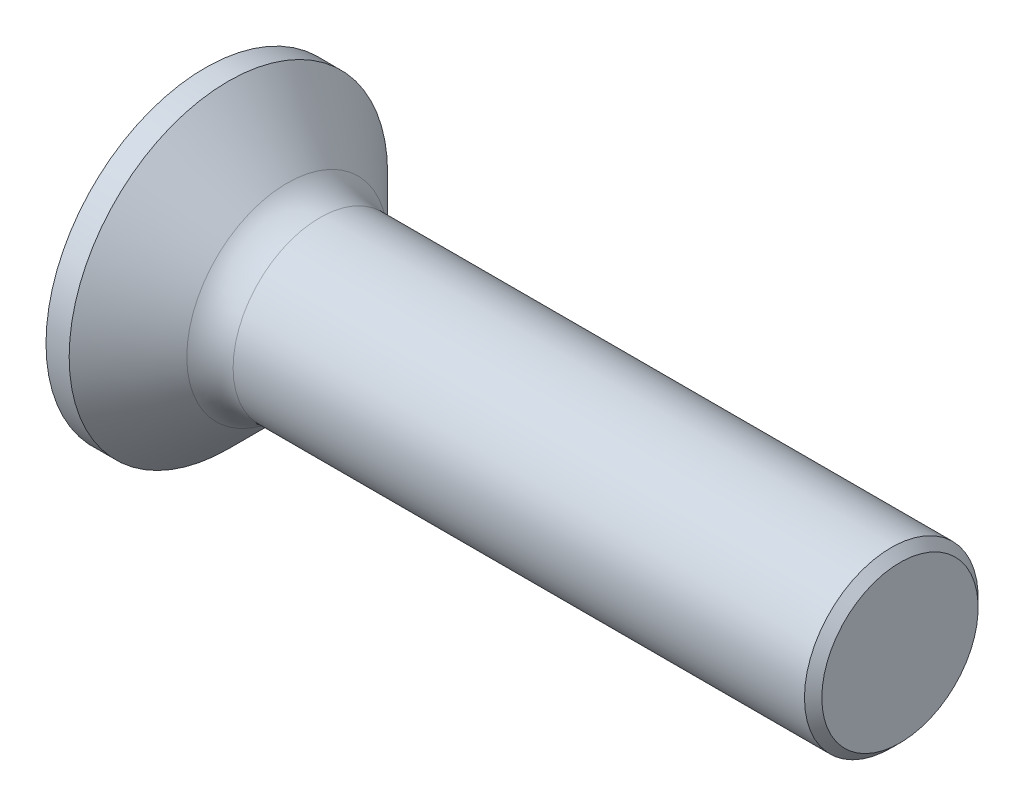
ISO-10303-21;
HEADER;
FILE_DESCRIPTION(('STEP AP214'),'2;1');
FILE_NAME('part.step','',(''),(''),'','','');
FILE_SCHEMA(('AUTOMOTIVE_DESIGN { 1 0 10303 214 1 1 1 1 }'));
ENDSEC;
DATA;
#1=APPLICATION_CONTEXT('core data for automotive mechanical design processes');
#2=APPLICATION_PROTOCOL_DEFINITION('international standard','automotive_design',2000,#1);
#3=PRODUCT_CONTEXT('',#1,'mechanical');
#4=PRODUCT('Part','Part','',(#3));
#5=PRODUCT_RELATED_PRODUCT_CATEGORY('part','',(#4));
#6=PRODUCT_DEFINITION_FORMATION('','',#4);
#7=PRODUCT_DEFINITION_CONTEXT('part definition',#1,'design');
#8=PRODUCT_DEFINITION('design','',#6,#7);
#9=PRODUCT_DEFINITION_SHAPE('','',#8);
#10=(LENGTH_UNIT() NAMED_UNIT(*) SI_UNIT(.MILLI.,.METRE.));
#11=(NAMED_UNIT(*) PLANE_ANGLE_UNIT() SI_UNIT($,.RADIAN.));
#12=(NAMED_UNIT(*) SI_UNIT($,.STERADIAN.) SOLID_ANGLE_UNIT());
#13=UNCERTAINTY_MEASURE_WITH_UNIT(LENGTH_MEASURE(1.E-05),#10,'distance_accuracy_value','');
#14=(GEOMETRIC_REPRESENTATION_CONTEXT(3) GLOBAL_UNCERTAINTY_ASSIGNED_CONTEXT((#13)) GLOBAL_UNIT_ASSIGNED_CONTEXT((#10,
#11,#12)) REPRESENTATION_CONTEXT('',''));
#15=CARTESIAN_POINT('',(0.,0.,0.));
#16=DIRECTION('',(0.,0.,1.));
#17=DIRECTION('',(1.,0.,0.));
#18=AXIS2_PLACEMENT_3D('',#15,#16,#17);
#19=CARTESIAN_POINT('',(0.,0.,-0.425));
#20=DIRECTION('',(0.,0.,1.));
#21=DIRECTION('',(1.,0.,0.));
#22=AXIS2_PLACEMENT_3D('',#19,#20,#21);
#23=PLANE('',#22);
#24=DIRECTION('',(1.,0.,0.));
#25=VECTOR('',#24,1.);
#26=CARTESIAN_POINT('',(0.,-0.419753086419753,-0.425));
#27=LINE('',#26,#25);
#28=CARTESIAN_POINT('',(2.5245,-0.419753086419753,-0.425));
#29=VERTEX_POINT('',#28);
#30=CARTESIAN_POINT('',(1.,-0.419753086419753,-0.425));
#31=VERTEX_POINT('',#30);
#32=EDGE_CURVE('E398',#29,#31,#27,.F.);
#33=ORIENTED_EDGE('',*,*,#32,.T.);
#34=DIRECTION('',(0.,1.,0.));
#35=VECTOR('',#34,1.);
#36=CARTESIAN_POINT('',(1.,0.,-0.425));
#37=LINE('',#36,#35);
#38=CARTESIAN_POINT('',(1.,-0.55003270446328,-0.425));
#39=VERTEX_POINT('',#38);
#40=EDGE_CURVE('E225',#31,#39,#37,.F.);
#41=ORIENTED_EDGE('',*,*,#40,.T.);
#42=DIRECTION('',(1.,0.,0.));
#43=VECTOR('',#42,1.);
#44=CARTESIAN_POINT('',(0.,-0.55003270446328,-0.425));
#45=LINE('',#44,#43);
#46=CARTESIAN_POINT('',(0.,-0.55003270446328,-0.425));
#47=VERTEX_POINT('',#46);
#48=EDGE_CURVE('E199',#39,#47,#45,.F.);
#49=ORIENTED_EDGE('',*,*,#48,.T.);
#50=DIRECTION('',(0.,1.,0.));
#51=VECTOR('',#50,1.);
#52=CARTESIAN_POINT('',(0.,0.,-0.425));
#53=LINE('',#52,#51);
#54=CARTESIAN_POINT('',(0.,-1.7,-0.425));
#55=VERTEX_POINT('',#54);
#56=EDGE_CURVE('E206',#47,#55,#53,.F.);
#57=ORIENTED_EDGE('',*,*,#56,.T.);
#58=DIRECTION('',(1.,0.,0.));
#59=VECTOR('',#58,1.);
#60=CARTESIAN_POINT('',(0.,-1.7,-0.425));
#61=LINE('',#60,#59);
#62=CARTESIAN_POINT('',(0.825,-1.7,-0.425));
#63=VERTEX_POINT('',#62);
#64=EDGE_CURVE('E215',#55,#63,#61,.T.);
#65=ORIENTED_EDGE('',*,*,#64,.T.);
#66=DIRECTION('',(0.799915270195533,0.600112956457372,0.));
#67=VECTOR('',#66,1.);
#68=CARTESIAN_POINT('',(0.825,-1.7,-0.425));
#69=LINE('',#68,#67);
#70=CARTESIAN_POINT('',(2.5245,-0.425,-0.425));
#71=VERTEX_POINT('',#70);
#72=EDGE_CURVE('E392',#63,#71,#69,.T.);
#73=ORIENTED_EDGE('',*,*,#72,.T.);
#74=DIRECTION('',(0.,1.,0.));
#75=VECTOR('',#74,1.);
#76=CARTESIAN_POINT('',(2.5245,0.,-0.425));
#77=LINE('',#76,#75);
#78=EDGE_CURVE('E400',#71,#29,#77,.T.);
#79=ORIENTED_EDGE('',*,*,#78,.T.);
#80=EDGE_LOOP('',(#33,#41,#49,#57,#65,#73,#79));
#81=FACE_BOUND('',#80,.T.);
#82=ADVANCED_FACE('F15',(#81),#23,.T.);
#83=CARTESIAN_POINT('',(0.825,-1.7,0.425));
#84=DIRECTION('',(0.600112956457372,-0.799915270195533,0.));
#85=DIRECTION('',(0.799915270195533,0.600112956457372,0.));
#86=AXIS2_PLACEMENT_3D('',#83,#84,#85);
#87=PLANE('',#86);
#88=DIRECTION('',(0.,0.,1.));
#89=VECTOR('',#88,1.);
#90=CARTESIAN_POINT('',(0.825,-1.7,0.425));
#91=LINE('',#90,#89);
#92=CARTESIAN_POINT('',(0.825,-1.7,0.425));
#93=VERTEX_POINT('',#92);
#94=EDGE_CURVE('E395',#93,#63,#91,.F.);
#95=ORIENTED_EDGE('',*,*,#94,.F.);
#96=DIRECTION('',(0.799915270195533,0.600112956457372,0.));
#97=VECTOR('',#96,1.);
#98=CARTESIAN_POINT('',(0.825,-1.7,0.425));
#99=LINE('',#98,#97);
#100=CARTESIAN_POINT('',(2.5245,-0.425,0.425));
#101=VERTEX_POINT('',#100);
#102=EDGE_CURVE('E383',#93,#101,#99,.T.);
#103=ORIENTED_EDGE('',*,*,#102,.T.);
#104=DIRECTION('',(0.,0.,-1.));
#105=VECTOR('',#104,1.);
#106=CARTESIAN_POINT('',(2.5245,-0.425,0.425));
#107=LINE('',#106,#105);
#108=EDGE_CURVE('E389',#101,#71,#107,.T.);
#109=ORIENTED_EDGE('',*,*,#108,.T.);
#110=ORIENTED_EDGE('',*,*,#72,.F.);
#111=EDGE_LOOP('',(#95,#103,#109,#110));
#112=FACE_BOUND('',#111,.T.);
#113=ADVANCED_FACE('F406',(#112),#87,.F.);
#114=CARTESIAN_POINT('',(2.5245,-0.425,0.425));
#115=DIRECTION('',(1.,0.,0.));
#116=DIRECTION('',(0.,0.,-1.));
#117=AXIS2_PLACEMENT_3D('',#114,#115,#116);
#118=PLANE('',#117);
#119=ORIENTED_EDGE('',*,*,#78,.F.);
#120=ORIENTED_EDGE('',*,*,#108,.F.);
#121=DIRECTION('',(0.,1.,0.));
#122=VECTOR('',#121,1.);
#123=CARTESIAN_POINT('',(2.5245,0.,0.425));
#124=LINE('',#123,#122);
#125=CARTESIAN_POINT('',(2.5245,-0.419753086419753,0.425));
#126=VERTEX_POINT('',#125);
#127=EDGE_CURVE('E381',#101,#126,#124,.T.);
#128=ORIENTED_EDGE('',*,*,#127,.T.);
#129=DIRECTION('',(0.,0.,1.));
#130=VECTOR('',#129,1.);
#131=CARTESIAN_POINT('',(2.5245,-0.419753086419753,0.));
#132=LINE('',#131,#130);
#133=EDGE_CURVE('E357',#29,#126,#132,.T.);
#134=ORIENTED_EDGE('',*,*,#133,.F.);
#135=EDGE_LOOP('',(#119,#120,#128,#134));
#136=FACE_BOUND('',#135,.T.);
#137=ADVANCED_FACE('F411',(#136),#118,.F.);
#138=CARTESIAN_POINT('',(0.,0.,0.425));
#139=DIRECTION('',(0.,0.,1.));
#140=DIRECTION('',(1.,0.,0.));
#141=AXIS2_PLACEMENT_3D('',#138,#139,#140);
#142=PLANE('',#141);
#143=DIRECTION('',(0.,1.,0.));
#144=VECTOR('',#143,1.);
#145=CARTESIAN_POINT('',(1.,0.,0.425));
#146=LINE('',#145,#144);
#147=CARTESIAN_POINT('',(1.,-0.419753086419753,0.425));
#148=VERTEX_POINT('',#147);
#149=CARTESIAN_POINT('',(1.,-0.55003270446328,0.425));
#150=VERTEX_POINT('',#149);
#151=EDGE_CURVE('E379',#148,#150,#146,.F.);
#152=ORIENTED_EDGE('',*,*,#151,.F.);
#153=DIRECTION('',(1.,0.,0.));
#154=VECTOR('',#153,1.);
#155=CARTESIAN_POINT('',(0.,-0.419753086419753,0.425));
#156=LINE('',#155,#154);
#157=EDGE_CURVE('E354',#126,#148,#156,.F.);
#158=ORIENTED_EDGE('',*,*,#157,.F.);
#159=ORIENTED_EDGE('',*,*,#127,.F.);
#160=ORIENTED_EDGE('',*,*,#102,.F.);
#161=DIRECTION('',(1.,0.,0.));
#162=VECTOR('',#161,1.);
#163=CARTESIAN_POINT('',(0.,-1.7,0.425));
#164=LINE('',#163,#162);
#165=CARTESIAN_POINT('',(0.,-1.7,0.425));
#166=VERTEX_POINT('',#165);
#167=EDGE_CURVE('E385',#166,#93,#164,.T.);
#168=ORIENTED_EDGE('',*,*,#167,.F.);
#169=DIRECTION('',(0.,1.,0.));
#170=VECTOR('',#169,1.);
#171=CARTESIAN_POINT('',(0.,0.,0.425));
#172=LINE('',#171,#170);
#173=CARTESIAN_POINT('',(0.,-0.55003270446328,0.425));
#174=VERTEX_POINT('',#173);
#175=EDGE_CURVE('E387',#174,#166,#172,.F.);
#176=ORIENTED_EDGE('',*,*,#175,.F.);
#177=DIRECTION('',(1.,0.,0.));
#178=VECTOR('',#177,1.);
#179=CARTESIAN_POINT('',(0.,-0.55003270446328,0.425));
#180=LINE('',#179,#178);
#181=EDGE_CURVE('E377',#150,#174,#180,.F.);
#182=ORIENTED_EDGE('',*,*,#181,.F.);
#183=EDGE_LOOP('',(#152,#158,#159,#160,#168,#176,#182));
#184=FACE_BOUND('',#183,.T.);
#185=ADVANCED_FACE('F415',(#184),#142,.F.);
#186=CARTESIAN_POINT('',(0.,0.,-0.425));
#187=DIRECTION('',(0.,0.,1.));
#188=DIRECTION('',(1.,0.,0.));
#189=AXIS2_PLACEMENT_3D('',#186,#187,#188);
#190=PLANE('',#189);
#191=DIRECTION('',(1.,0.,0.));
#192=VECTOR('',#191,1.);
#193=CARTESIAN_POINT('',(0.,1.7,-0.425));
#194=LINE('',#193,#192);
#195=CARTESIAN_POINT('',(0.825,1.7,-0.425));
#196=VERTEX_POINT('',#195);
#197=CARTESIAN_POINT('',(0.,1.7,-0.425));
#198=VERTEX_POINT('',#197);
#199=EDGE_CURVE('E363',#196,#198,#194,.F.);
#200=ORIENTED_EDGE('',*,*,#199,.T.);
#201=DIRECTION('',(0.,1.,0.));
#202=VECTOR('',#201,1.);
#203=CARTESIAN_POINT('',(0.,0.,-0.425));
#204=LINE('',#203,#202);
#205=CARTESIAN_POINT('',(0.,0.55003270446328,-0.425));
#206=VERTEX_POINT('',#205);
#207=EDGE_CURVE('E360',#198,#206,#204,.F.);
#208=ORIENTED_EDGE('',*,*,#207,.T.);
#209=DIRECTION('',(1.,0.,0.));
#210=VECTOR('',#209,1.);
#211=CARTESIAN_POINT('',(0.,0.55003270446328,-0.425));
#212=LINE('',#211,#210);
#213=CARTESIAN_POINT('',(1.,0.55003270446328,-0.425));
#214=VERTEX_POINT('',#213);
#215=EDGE_CURVE('E374',#206,#214,#212,.T.);
#216=ORIENTED_EDGE('',*,*,#215,.T.);
#217=DIRECTION('',(0.,1.,0.));
#218=VECTOR('',#217,1.);
#219=CARTESIAN_POINT('',(1.,0.,-0.425));
#220=LINE('',#219,#218);
#221=CARTESIAN_POINT('',(1.,0.419753086419753,-0.425));
#222=VERTEX_POINT('',#221);
#223=EDGE_CURVE('E371',#214,#222,#220,.F.);
#224=ORIENTED_EDGE('',*,*,#223,.T.);
#225=DIRECTION('',(1.,0.,0.));
#226=VECTOR('',#225,1.);
#227=CARTESIAN_POINT('',(0.,0.419753086419753,-0.425));
#228=LINE('',#227,#226);
#229=CARTESIAN_POINT('',(2.5245,0.419753086419753,-0.425));
#230=VERTEX_POINT('',#229);
#231=EDGE_CURVE('E368',#222,#230,#228,.T.);
#232=ORIENTED_EDGE('',*,*,#231,.T.);
#233=DIRECTION('',(0.,1.,0.));
#234=VECTOR('',#233,1.);
#235=CARTESIAN_POINT('',(2.5245,0.,-0.425));
#236=LINE('',#235,#234);
#237=CARTESIAN_POINT('',(2.5245,0.425,-0.425));
#238=VERTEX_POINT('',#237);
#239=EDGE_CURVE('E366',#230,#238,#236,.T.);
#240=ORIENTED_EDGE('',*,*,#239,.T.);
#241=DIRECTION('',(-0.799915270195533,0.600112956457372,0.));
#242=VECTOR('',#241,1.);
#243=CARTESIAN_POINT('',(2.5245,0.425,-0.425));
#244=LINE('',#243,#242);
#245=EDGE_CURVE('E335',#238,#196,#244,.T.);
#246=ORIENTED_EDGE('',*,*,#245,.T.);
#247=EDGE_LOOP('',(#200,#208,#216,#224,#232,#240,#246));
#248=FACE_BOUND('',#247,.T.);
#249=ADVANCED_FACE('F463',(#248),#190,.T.);
#250=CARTESIAN_POINT('',(0.,-0.419753086419753,0.));
#251=DIRECTION('',(0.,1.,0.));
#252=DIRECTION('',(0.,0.,1.));
#253=AXIS2_PLACEMENT_3D('',#250,#251,#252);
#254=PLANE('',#253);
#255=DIRECTION('',(0.,0.,1.));
#256=VECTOR('',#255,1.);
#257=CARTESIAN_POINT('',(0.,-0.419753086419753,0.));
#258=LINE('',#257,#256);
#259=CARTESIAN_POINT('',(0.,-0.419753086419753,-1.7));
#260=VERTEX_POINT('',#259);
#261=CARTESIAN_POINT('',(0.,-0.419753086419753,-0.545630021213276));
#262=VERTEX_POINT('',#261);
#263=EDGE_CURVE('E340',#260,#262,#258,.T.);
#264=ORIENTED_EDGE('',*,*,#263,.T.);
#265=DIRECTION('',(1.,0.,0.));
#266=VECTOR('',#265,1.);
#267=CARTESIAN_POINT('',(0.,-0.419753086419753,-0.545630021213276));
#268=LINE('',#267,#266);
#269=CARTESIAN_POINT('',(1.,-0.419753086419753,-0.545630021213276));
#270=VERTEX_POINT('',#269);
#271=EDGE_CURVE('E338',#262,#270,#268,.T.);
#272=ORIENTED_EDGE('',*,*,#271,.T.);
#273=DIRECTION('',(0.,0.,1.));
#274=VECTOR('',#273,1.);
#275=CARTESIAN_POINT('',(1.,-0.419753086419753,0.));
#276=LINE('',#275,#274);
#277=EDGE_CURVE('E329',#31,#270,#276,.F.);
#278=ORIENTED_EDGE('',*,*,#277,.F.);
#279=ORIENTED_EDGE('',*,*,#32,.F.);
#280=ORIENTED_EDGE('',*,*,#133,.T.);
#281=ORIENTED_EDGE('',*,*,#157,.T.);
#282=DIRECTION('',(0.,0.,1.));
#283=VECTOR('',#282,1.);
#284=CARTESIAN_POINT('',(1.,-0.419753086419753,0.));
#285=LINE('',#284,#283);
#286=CARTESIAN_POINT('',(1.,-0.419753086419753,0.545630021213276));
#287=VERTEX_POINT('',#286);
#288=EDGE_CURVE('E332',#287,#148,#285,.F.);
#289=ORIENTED_EDGE('',*,*,#288,.F.);
#290=DIRECTION('',(1.,0.,0.));
#291=VECTOR('',#290,1.);
#292=CARTESIAN_POINT('',(0.,-0.419753086419753,0.545630021213276));
#293=LINE('',#292,#291);
#294=CARTESIAN_POINT('',(0.,-0.419753086419753,0.545630021213276));
#295=VERTEX_POINT('',#294);
#296=EDGE_CURVE('E351',#287,#295,#293,.F.);
#297=ORIENTED_EDGE('',*,*,#296,.T.);
#298=DIRECTION('',(0.,0.,1.));
#299=VECTOR('',#298,1.);
#300=CARTESIAN_POINT('',(0.,-0.419753086419753,0.));
#301=LINE('',#300,#299);
#302=CARTESIAN_POINT('',(0.,-0.419753086419753,1.7));
#303=VERTEX_POINT('',#302);
#304=EDGE_CURVE('E348',#295,#303,#301,.T.);
#305=ORIENTED_EDGE('',*,*,#304,.T.);
#306=DIRECTION('',(1.,0.,0.));
#307=VECTOR('',#306,1.);
#308=CARTESIAN_POINT('',(0.,-0.419753086419753,1.7));
#309=LINE('',#308,#307);
#310=CARTESIAN_POINT('',(0.825,-0.419753086419753,1.7));
#311=VERTEX_POINT('',#310);
#312=EDGE_CURVE('E346',#303,#311,#309,.T.);
#313=ORIENTED_EDGE('',*,*,#312,.T.);
#314=DIRECTION('',(0.802769432970874,0.,-0.596289558425788));
#315=VECTOR('',#314,1.);
#316=CARTESIAN_POINT('',(0.825,-0.419753086419753,1.7));
#317=LINE('',#316,#315);
#318=CARTESIAN_POINT('',(2.5415,-0.419753086419753,0.425));
#319=VERTEX_POINT('',#318);
#320=EDGE_CURVE('E325',#311,#319,#317,.T.);
#321=ORIENTED_EDGE('',*,*,#320,.T.);
#322=DIRECTION('',(0.,0.,-1.));
#323=VECTOR('',#322,1.);
#324=CARTESIAN_POINT('',(2.5415,-0.419753086419753,0.425));
#325=LINE('',#324,#323);
#326=CARTESIAN_POINT('',(2.5415,-0.419753086419753,-0.425));
#327=VERTEX_POINT('',#326);
#328=EDGE_CURVE('E320',#319,#327,#325,.T.);
#329=ORIENTED_EDGE('',*,*,#328,.T.);
#330=DIRECTION('',(-0.802769432970874,0.,-0.596289558425788));
#331=VECTOR('',#330,1.);
#332=CARTESIAN_POINT('',(2.5415,-0.419753086419753,-0.425));
#333=LINE('',#332,#331);
#334=CARTESIAN_POINT('',(0.825,-0.419753086419753,-1.7));
#335=VERTEX_POINT('',#334);
#336=EDGE_CURVE('E314',#327,#335,#333,.T.);
#337=ORIENTED_EDGE('',*,*,#336,.T.);
#338=DIRECTION('',(1.,0.,0.));
#339=VECTOR('',#338,1.);
#340=CARTESIAN_POINT('',(0.,-0.419753086419753,-1.7));
#341=LINE('',#340,#339);
#342=EDGE_CURVE('E343',#335,#260,#341,.F.);
#343=ORIENTED_EDGE('',*,*,#342,.T.);
#344=EDGE_LOOP('',(#264,#272,#278,#279,#280,#281,#289,#297,#305,#313,#321,#329,#337,#343));
#345=FACE_BOUND('',#344,.T.);
#346=ADVANCED_FACE('F420',(#345),#254,.T.);
#347=CARTESIAN_POINT('',(2.5245,0.425,0.425));
#348=DIRECTION('',(0.600112956457372,0.799915270195533,0.));
#349=DIRECTION('',(-0.799915270195533,0.600112956457372,0.));
#350=AXIS2_PLACEMENT_3D('',#347,#348,#349);
#351=PLANE('',#350);
#352=DIRECTION('',(0.,0.,-1.));
#353=VECTOR('',#352,1.);
#354=CARTESIAN_POINT('',(2.5245,0.425,0.425));
#355=LINE('',#354,#353);
#356=CARTESIAN_POINT('',(2.5245,0.425,0.425));
#357=VERTEX_POINT('',#356);
#358=EDGE_CURVE('E327',#238,#357,#355,.F.);
#359=ORIENTED_EDGE('',*,*,#358,.T.);
#360=DIRECTION('',(-0.799915270195533,0.600112956457372,0.));
#361=VECTOR('',#360,1.);
#362=CARTESIAN_POINT('',(2.5245,0.425,0.425));
#363=LINE('',#362,#361);
#364=CARTESIAN_POINT('',(0.825,1.7,0.425));
#365=VERTEX_POINT('',#364);
#366=EDGE_CURVE('E302',#357,#365,#363,.T.);
#367=ORIENTED_EDGE('',*,*,#366,.T.);
#368=DIRECTION('',(0.,0.,1.));
#369=VECTOR('',#368,1.);
#370=CARTESIAN_POINT('',(0.825,1.7,0.425));
#371=LINE('',#370,#369);
#372=EDGE_CURVE('E309',#365,#196,#371,.F.);
#373=ORIENTED_EDGE('',*,*,#372,.T.);
#374=ORIENTED_EDGE('',*,*,#245,.F.);
#375=EDGE_LOOP('',(#359,#367,#373,#374));
#376=FACE_BOUND('',#375,.T.);
#377=ADVANCED_FACE('F590',(#376),#351,.F.);
#378=CARTESIAN_POINT('',(1.,0.,0.));
#379=DIRECTION('',(-1.,0.,0.));
#380=DIRECTION('',(0.,0.,1.));
#381=AXIS2_PLACEMENT_3D('',#378,#379,#380);
#382=PLANE('',#381);
#383=DIRECTION('',(0.,-0.766044443118978,0.642787609686539));
#384=VECTOR('',#383,1.);
#385=CARTESIAN_POINT('',(1.,-1.20208152801713,1.20208152801713));
#386=LINE('',#385,#384);
#387=CARTESIAN_POINT('',(1.,-1.20208152801713,1.20208152801713));
#388=VERTEX_POINT('',#387);
#389=EDGE_CURVE('E287',#388,#287,#386,.F.);
#390=ORIENTED_EDGE('',*,*,#389,.T.);
#391=ORIENTED_EDGE('',*,*,#288,.T.);
#392=ORIENTED_EDGE('',*,*,#151,.T.);
#393=DIRECTION('',(0.,0.642787609686539,-0.766044443118978));
#394=VECTOR('',#393,1.);
#395=CARTESIAN_POINT('',(1.,-0.193415361212936,0.));
#396=LINE('',#395,#394);
#397=EDGE_CURVE('E285',#150,#388,#396,.F.);
#398=ORIENTED_EDGE('',*,*,#397,.T.);
#399=EDGE_LOOP('',(#390,#391,#392,#398));
#400=FACE_BOUND('',#399,.T.);
#401=ADVANCED_FACE('F587',(#400),#382,.T.);
#402=CARTESIAN_POINT('',(1.,0.,0.));
#403=DIRECTION('',(-1.,0.,0.));
#404=DIRECTION('',(0.,0.,1.));
#405=AXIS2_PLACEMENT_3D('',#402,#403,#404);
#406=PLANE('',#405);
#407=DIRECTION('',(0.,0.766044443118978,0.642787609686539));
#408=VECTOR('',#407,1.);
#409=CARTESIAN_POINT('',(1.,0.,-0.193415361212936));
#410=LINE('',#409,#408);
#411=CARTESIAN_POINT('',(1.,-1.20208152801713,-1.20208152801713));
#412=VERTEX_POINT('',#411);
#413=EDGE_CURVE('E279',#270,#412,#410,.F.);
#414=ORIENTED_EDGE('',*,*,#413,.T.);
#415=DIRECTION('',(0.,-0.642787609686539,-0.766044443118978));
#416=VECTOR('',#415,1.);
#417=CARTESIAN_POINT('',(1.,-1.20208152801713,-1.20208152801713));
#418=LINE('',#417,#416);
#419=EDGE_CURVE('E281',#412,#39,#418,.F.);
#420=ORIENTED_EDGE('',*,*,#419,.T.);
#421=ORIENTED_EDGE('',*,*,#40,.F.);
#422=ORIENTED_EDGE('',*,*,#277,.T.);
#423=EDGE_LOOP('',(#414,#420,#421,#422));
#424=FACE_BOUND('',#423,.T.);
#425=ADVANCED_FACE('F424',(#424),#406,.T.);
#426=CARTESIAN_POINT('',(2.5245,-0.425,0.425));
#427=DIRECTION('',(1.,0.,0.));
#428=DIRECTION('',(0.,0.,-1.));
#429=AXIS2_PLACEMENT_3D('',#426,#427,#428);
#430=PLANE('',#429);
#431=DIRECTION('',(0.,1.,0.));
#432=VECTOR('',#431,1.);
#433=CARTESIAN_POINT('',(2.5245,0.,0.425));
#434=LINE('',#433,#432);
#435=CARTESIAN_POINT('',(2.5245,0.419753086419753,0.425));
#436=VERTEX_POINT('',#435);
#437=EDGE_CURVE('E304',#436,#357,#434,.T.);
#438=ORIENTED_EDGE('',*,*,#437,.T.);
#439=ORIENTED_EDGE('',*,*,#358,.F.);
#440=ORIENTED_EDGE('',*,*,#239,.F.);
#441=DIRECTION('',(0.,0.,1.));
#442=VECTOR('',#441,1.);
#443=CARTESIAN_POINT('',(2.5245,0.419753086419753,0.));
#444=LINE('',#443,#442);
#445=EDGE_CURVE('E273',#230,#436,#444,.T.);
#446=ORIENTED_EDGE('',*,*,#445,.T.);
#447=EDGE_LOOP('',(#438,#439,#440,#446));
#448=FACE_BOUND('',#447,.T.);
#449=ADVANCED_FACE('F580',(#448),#430,.F.);
#450=CARTESIAN_POINT('',(1.,0.,0.));
#451=DIRECTION('',(-1.,0.,0.));
#452=DIRECTION('',(0.,0.,1.));
#453=AXIS2_PLACEMENT_3D('',#450,#451,#452);
#454=PLANE('',#453);
#455=DIRECTION('',(0.,-0.766044443118978,-0.642787609686539));
#456=VECTOR('',#455,1.);
#457=CARTESIAN_POINT('',(1.,0.,0.193415361212936));
#458=LINE('',#457,#456);
#459=CARTESIAN_POINT('',(1.,0.419753086419753,0.545630021213276));
#460=VERTEX_POINT('',#459);
#461=CARTESIAN_POINT('',(1.,1.20208152801713,1.20208152801713));
#462=VERTEX_POINT('',#461);
#463=EDGE_CURVE('E294',#460,#462,#458,.F.);
#464=ORIENTED_EDGE('',*,*,#463,.T.);
#465=DIRECTION('',(0.,0.642787609686539,0.766044443118978));
#466=VECTOR('',#465,1.);
#467=CARTESIAN_POINT('',(1.,1.20208152801713,1.20208152801713));
#468=LINE('',#467,#466);
#469=CARTESIAN_POINT('',(1.,0.55003270446328,0.425));
#470=VERTEX_POINT('',#469);
#471=EDGE_CURVE('E298',#462,#470,#468,.F.);
#472=ORIENTED_EDGE('',*,*,#471,.T.);
#473=DIRECTION('',(0.,1.,0.));
#474=VECTOR('',#473,1.);
#475=CARTESIAN_POINT('',(1.,0.,0.425));
#476=LINE('',#475,#474);
#477=CARTESIAN_POINT('',(1.,0.419753086419753,0.425));
#478=VERTEX_POINT('',#477);
#479=EDGE_CURVE('E307',#470,#478,#476,.F.);
#480=ORIENTED_EDGE('',*,*,#479,.T.);
#481=DIRECTION('',(0.,0.,1.));
#482=VECTOR('',#481,1.);
#483=CARTESIAN_POINT('',(1.,0.419753086419753,0.));
#484=LINE('',#483,#482);
#485=EDGE_CURVE('E268',#478,#460,#484,.T.);
#486=ORIENTED_EDGE('',*,*,#485,.T.);
#487=EDGE_LOOP('',(#464,#472,#480,#486));
#488=FACE_BOUND('',#487,.T.);
#489=ADVANCED_FACE('F577',(#488),#454,.T.);
#490=CARTESIAN_POINT('',(0.825,0.419753086419753,1.7));
#491=DIRECTION('',(0.596289558425788,0.,0.802769432970874));
#492=DIRECTION('',(0.802769432970874,0.,-0.596289558425788));
#493=AXIS2_PLACEMENT_3D('',#490,#491,#492);
#494=PLANE('',#493);
#495=DIRECTION('',(0.,1.,0.));
#496=VECTOR('',#495,1.);
#497=CARTESIAN_POINT('',(0.825,0.419753086419753,1.7));
#498=LINE('',#497,#496);
#499=CARTESIAN_POINT('',(0.825,0.419753086419753,1.7));
#500=VERTEX_POINT('',#499);
#501=EDGE_CURVE('E290',#311,#500,#498,.T.);
#502=ORIENTED_EDGE('',*,*,#501,.T.);
#503=DIRECTION('',(0.802769432970874,0.,-0.596289558425788));
#504=VECTOR('',#503,1.);
#505=CARTESIAN_POINT('',(0.825,0.419753086419753,1.7));
#506=LINE('',#505,#504);
#507=CARTESIAN_POINT('',(2.5415,0.419753086419753,0.425));
#508=VERTEX_POINT('',#507);
#509=EDGE_CURVE('E261',#500,#508,#506,.T.);
#510=ORIENTED_EDGE('',*,*,#509,.T.);
#511=DIRECTION('',(0.,1.,0.));
#512=VECTOR('',#511,1.);
#513=CARTESIAN_POINT('',(2.5415,0.419753086419753,0.425));
#514=LINE('',#513,#512);
#515=EDGE_CURVE('E322',#508,#319,#514,.F.);
#516=ORIENTED_EDGE('',*,*,#515,.T.);
#517=ORIENTED_EDGE('',*,*,#320,.F.);
#518=EDGE_LOOP('',(#502,#510,#516,#517));
#519=FACE_BOUND('',#518,.T.);
#520=ADVANCED_FACE('F546',(#519),#494,.F.);
#521=CARTESIAN_POINT('',(2.5415,0.419753086419753,0.425));
#522=DIRECTION('',(1.,0.,0.));
#523=DIRECTION('',(0.,0.,-1.));
#524=AXIS2_PLACEMENT_3D('',#521,#522,#523);
#525=PLANE('',#524);
#526=ORIENTED_EDGE('',*,*,#515,.F.);
#527=DIRECTION('',(0.,0.,1.));
#528=VECTOR('',#527,1.);
#529=CARTESIAN_POINT('',(2.5415,0.419753086419753,0.));
#530=LINE('',#529,#528);
#531=CARTESIAN_POINT('',(2.5415,0.419753086419753,-0.425));
#532=VERTEX_POINT('',#531);
#533=EDGE_CURVE('E259',#508,#532,#530,.F.);
#534=ORIENTED_EDGE('',*,*,#533,.T.);
#535=DIRECTION('',(0.,1.,0.));
#536=VECTOR('',#535,1.);
#537=CARTESIAN_POINT('',(2.5415,0.419753086419753,-0.425));
#538=LINE('',#537,#536);
#539=EDGE_CURVE('E317',#532,#327,#538,.F.);
#540=ORIENTED_EDGE('',*,*,#539,.T.);
#541=ORIENTED_EDGE('',*,*,#328,.F.);
#542=EDGE_LOOP('',(#526,#534,#540,#541));
#543=FACE_BOUND('',#542,.T.);
#544=ADVANCED_FACE('F544',(#543),#525,.F.);
#545=CARTESIAN_POINT('',(2.5415,0.419753086419753,-0.425));
#546=DIRECTION('',(0.596289558425788,0.,-0.802769432970874));
#547=DIRECTION('',(-0.802769432970874,0.,-0.596289558425788));
#548=AXIS2_PLACEMENT_3D('',#545,#546,#547);
#549=PLANE('',#548);
#550=ORIENTED_EDGE('',*,*,#539,.F.);
#551=DIRECTION('',(-0.802769432970874,0.,-0.596289558425788));
#552=VECTOR('',#551,1.);
#553=CARTESIAN_POINT('',(2.5415,0.419753086419753,-0.425));
#554=LINE('',#553,#552);
#555=CARTESIAN_POINT('',(0.825,0.419753086419753,-1.7));
#556=VERTEX_POINT('',#555);
#557=EDGE_CURVE('E257',#532,#556,#554,.T.);
#558=ORIENTED_EDGE('',*,*,#557,.T.);
#559=DIRECTION('',(0.,1.,0.));
#560=VECTOR('',#559,1.);
#561=CARTESIAN_POINT('',(0.825,0.419753086419753,-1.7));
#562=LINE('',#561,#560);
#563=EDGE_CURVE('E275',#556,#335,#562,.F.);
#564=ORIENTED_EDGE('',*,*,#563,.T.);
#565=ORIENTED_EDGE('',*,*,#336,.F.);
#566=EDGE_LOOP('',(#550,#558,#564,#565));
#567=FACE_BOUND('',#566,.T.);
#568=ADVANCED_FACE('F540',(#567),#549,.F.);
#569=CARTESIAN_POINT('',(1.,0.,0.));
#570=DIRECTION('',(-1.,0.,0.));
#571=DIRECTION('',(0.,0.,1.));
#572=AXIS2_PLACEMENT_3D('',#569,#570,#571);
#573=PLANE('',#572);
#574=DIRECTION('',(0.,0.766044443118978,-0.642787609686539));
#575=VECTOR('',#574,1.);
#576=CARTESIAN_POINT('',(1.,1.20208152801713,-1.20208152801713));
#577=LINE('',#576,#575);
#578=CARTESIAN_POINT('',(1.,1.20208152801713,-1.20208152801713));
#579=VERTEX_POINT('',#578);
#580=CARTESIAN_POINT('',(1.,0.419753086419753,-0.545630021213276));
#581=VERTEX_POINT('',#580);
#582=EDGE_CURVE('E247',#579,#581,#577,.F.);
#583=ORIENTED_EDGE('',*,*,#582,.T.);
#584=DIRECTION('',(0.,0.,1.));
#585=VECTOR('',#584,1.);
#586=CARTESIAN_POINT('',(1.,0.419753086419753,0.));
#587=LINE('',#586,#585);
#588=EDGE_CURVE('E252',#581,#222,#587,.T.);
#589=ORIENTED_EDGE('',*,*,#588,.T.);
#590=ORIENTED_EDGE('',*,*,#223,.F.);
#591=DIRECTION('',(0.,-0.642787609686539,0.766044443118978));
#592=VECTOR('',#591,1.);
#593=CARTESIAN_POINT('',(1.,0.193415361212936,0.));
#594=LINE('',#593,#592);
#595=EDGE_CURVE('E312',#214,#579,#594,.F.);
#596=ORIENTED_EDGE('',*,*,#595,.T.);
#597=EDGE_LOOP('',(#583,#589,#590,#596));
#598=FACE_BOUND('',#597,.T.);
#599=ADVANCED_FACE('F567',(#598),#573,.T.);
#600=CARTESIAN_POINT('',(0.,0.193415361212936,0.));
#601=DIRECTION('',(0.,0.766044443118978,0.642787609686539));
#602=DIRECTION('',(0.,-0.642787609686539,0.766044443118978));
#603=AXIS2_PLACEMENT_3D('',#600,#601,#602);
#604=PLANE('',#603);
#605=DIRECTION('',(0.,-0.642787609686539,0.766044443118978));
#606=VECTOR('',#605,1.);
#607=CARTESIAN_POINT('',(0.,1.20208152801713,-1.20208152801713));
#608=LINE('',#607,#606);
#609=CARTESIAN_POINT('',(0.,1.20208152801713,-1.20208152801713));
#610=VERTEX_POINT('',#609);
#611=EDGE_CURVE('E244',#610,#206,#608,.T.);
#612=ORIENTED_EDGE('',*,*,#611,.F.);
#613=DIRECTION('',(1.,0.,0.));
#614=VECTOR('',#613,1.);
#615=CARTESIAN_POINT('',(0.,1.20208152801713,-1.20208152801713));
#616=LINE('',#615,#614);
#617=EDGE_CURVE('E249',#610,#579,#616,.T.);
#618=ORIENTED_EDGE('',*,*,#617,.T.);
#619=ORIENTED_EDGE('',*,*,#595,.F.);
#620=ORIENTED_EDGE('',*,*,#215,.F.);
#621=EDGE_LOOP('',(#612,#618,#619,#620));
#622=FACE_BOUND('',#621,.T.);
#623=ADVANCED_FACE('F564',(#622),#604,.F.);
#624=CARTESIAN_POINT('',(0.825,1.7,0.425));
#625=DIRECTION('',(0.,1.,0.));
#626=DIRECTION('',(0.,0.,1.));
#627=AXIS2_PLACEMENT_3D('',#624,#625,#626);
#628=PLANE('',#627);
#629=ORIENTED_EDGE('',*,*,#199,.F.);
#630=ORIENTED_EDGE('',*,*,#372,.F.);
#631=DIRECTION('',(1.,0.,0.));
#632=VECTOR('',#631,1.);
#633=CARTESIAN_POINT('',(0.,1.7,0.425));
#634=LINE('',#633,#632);
#635=CARTESIAN_POINT('',(0.,1.7,0.425));
#636=VERTEX_POINT('',#635);
#637=EDGE_CURVE('E300',#365,#636,#634,.F.);
#638=ORIENTED_EDGE('',*,*,#637,.T.);
#639=DIRECTION('',(0.,0.,1.));
#640=VECTOR('',#639,1.);
#641=CARTESIAN_POINT('',(0.,1.7,-1.375));
#642=LINE('',#641,#640);
#643=EDGE_CURVE('E455',#198,#636,#642,.T.);
#644=ORIENTED_EDGE('',*,*,#643,.F.);
#645=EDGE_LOOP('',(#629,#630,#638,#644));
#646=FACE_BOUND('',#645,.T.);
#647=ADVANCED_FACE('F467',(#646),#628,.F.);
#648=CARTESIAN_POINT('',(0.,0.,0.425));
#649=DIRECTION('',(0.,0.,1.));
#650=DIRECTION('',(1.,0.,0.));
#651=AXIS2_PLACEMENT_3D('',#648,#649,#650);
#652=PLANE('',#651);
#653=DIRECTION('',(0.,1.,0.));
#654=VECTOR('',#653,1.);
#655=CARTESIAN_POINT('',(0.,0.,0.425));
#656=LINE('',#655,#654);
#657=CARTESIAN_POINT('',(0.,0.55003270446328,0.425));
#658=VERTEX_POINT('',#657);
#659=EDGE_CURVE('E453',#636,#658,#656,.F.);
#660=ORIENTED_EDGE('',*,*,#659,.F.);
#661=ORIENTED_EDGE('',*,*,#637,.F.);
#662=ORIENTED_EDGE('',*,*,#366,.F.);
#663=ORIENTED_EDGE('',*,*,#437,.F.);
#664=DIRECTION('',(1.,0.,0.));
#665=VECTOR('',#664,1.);
#666=CARTESIAN_POINT('',(0.,0.419753086419753,0.425));
#667=LINE('',#666,#665);
#668=EDGE_CURVE('E270',#436,#478,#667,.F.);
#669=ORIENTED_EDGE('',*,*,#668,.T.);
#670=ORIENTED_EDGE('',*,*,#479,.F.);
#671=DIRECTION('',(1.,0.,0.));
#672=VECTOR('',#671,1.);
#673=CARTESIAN_POINT('',(0.,0.55003270446328,0.425));
#674=LINE('',#673,#672);
#675=EDGE_CURVE('E296',#470,#658,#674,.F.);
#676=ORIENTED_EDGE('',*,*,#675,.T.);
#677=EDGE_LOOP('',(#660,#661,#662,#663,#669,#670,#676));
#678=FACE_BOUND('',#677,.T.);
#679=ADVANCED_FACE('F472',(#678),#652,.F.);
#680=CARTESIAN_POINT('',(0.,1.20208152801713,1.20208152801713));
#681=DIRECTION('',(0.,0.766044443118978,-0.642787609686539));
#682=DIRECTION('',(0.,0.642787609686539,0.766044443118978));
#683=AXIS2_PLACEMENT_3D('',#680,#681,#682);
#684=PLANE('',#683);
#685=ORIENTED_EDGE('',*,*,#471,.F.);
#686=DIRECTION('',(1.,0.,0.));
#687=VECTOR('',#686,1.);
#688=CARTESIAN_POINT('',(0.,1.20208152801713,1.20208152801713));
#689=LINE('',#688,#687);
#690=CARTESIAN_POINT('',(0.,1.20208152801713,1.20208152801713));
#691=VERTEX_POINT('',#690);
#692=EDGE_CURVE('E292',#462,#691,#689,.F.);
#693=ORIENTED_EDGE('',*,*,#692,.T.);
#694=DIRECTION('',(0.,0.642787609686539,0.766044443118978));
#695=VECTOR('',#694,1.);
#696=CARTESIAN_POINT('',(0.,0.55003270446328,0.425));
#697=LINE('',#696,#695);
#698=EDGE_CURVE('E450',#658,#691,#697,.T.);
#699=ORIENTED_EDGE('',*,*,#698,.F.);
#700=ORIENTED_EDGE('',*,*,#675,.F.);
#701=EDGE_LOOP('',(#685,#693,#699,#700));
#702=FACE_BOUND('',#701,.T.);
#703=ADVANCED_FACE('F479',(#702),#684,.F.);
#704=CARTESIAN_POINT('',(0.,0.,0.193415361212936));
#705=DIRECTION('',(0.,-0.642787609686539,0.766044443118978));
#706=DIRECTION('',(0.,-0.766044443118978,-0.642787609686539));
#707=AXIS2_PLACEMENT_3D('',#704,#705,#706);
#708=PLANE('',#707);
#709=DIRECTION('',(0.,-0.766044443118978,-0.642787609686539));
#710=VECTOR('',#709,1.);
#711=CARTESIAN_POINT('',(0.,1.20208152801713,1.20208152801713));
#712=LINE('',#711,#710);
#713=CARTESIAN_POINT('',(0.,0.419753086419753,0.545630021213276));
#714=VERTEX_POINT('',#713);
#715=EDGE_CURVE('E447',#691,#714,#712,.T.);
#716=ORIENTED_EDGE('',*,*,#715,.F.);
#717=ORIENTED_EDGE('',*,*,#692,.F.);
#718=ORIENTED_EDGE('',*,*,#463,.F.);
#719=DIRECTION('',(1.,0.,0.));
#720=VECTOR('',#719,1.);
#721=CARTESIAN_POINT('',(0.,0.419753086419753,0.545630021213276));
#722=LINE('',#721,#720);
#723=EDGE_CURVE('E266',#460,#714,#722,.F.);
#724=ORIENTED_EDGE('',*,*,#723,.T.);
#725=EDGE_LOOP('',(#716,#717,#718,#724));
#726=FACE_BOUND('',#725,.T.);
#727=ADVANCED_FACE('F483',(#726),#708,.F.);
#728=CARTESIAN_POINT('',(-1.,0.419753086419753,1.7));
#729=DIRECTION('',(0.,0.,1.));
#730=DIRECTION('',(1.,0.,0.));
#731=AXIS2_PLACEMENT_3D('',#728,#729,#730);
#732=PLANE('',#731);
#733=DIRECTION('',(1.,0.,0.));
#734=VECTOR('',#733,1.);
#735=CARTESIAN_POINT('',(0.,0.419753086419753,1.7));
#736=LINE('',#735,#734);
#737=CARTESIAN_POINT('',(0.,0.419753086419753,1.7));
#738=VERTEX_POINT('',#737);
#739=EDGE_CURVE('E263',#738,#500,#736,.T.);
#740=ORIENTED_EDGE('',*,*,#739,.T.);
#741=ORIENTED_EDGE('',*,*,#501,.F.);
#742=ORIENTED_EDGE('',*,*,#312,.F.);
#743=DIRECTION('',(0.,1.,0.));
#744=VECTOR('',#743,1.);
#745=CARTESIAN_POINT('',(0.,0.,1.7));
#746=LINE('',#745,#744);
#747=EDGE_CURVE('E441',#738,#303,#746,.F.);
#748=ORIENTED_EDGE('',*,*,#747,.F.);
#749=EDGE_LOOP('',(#740,#741,#742,#748));
#750=FACE_BOUND('',#749,.T.);
#751=ADVANCED_FACE('F548',(#750),#732,.F.);
#752=CARTESIAN_POINT('',(0.,-1.20208152801713,1.20208152801713));
#753=DIRECTION('',(0.,0.642787609686539,0.766044443118978));
#754=DIRECTION('',(0.,-0.766044443118978,0.642787609686539));
#755=AXIS2_PLACEMENT_3D('',#752,#753,#754);
#756=PLANE('',#755);
#757=ORIENTED_EDGE('',*,*,#389,.F.);
#758=DIRECTION('',(1.,0.,0.));
#759=VECTOR('',#758,1.);
#760=CARTESIAN_POINT('',(0.,-1.20208152801713,1.20208152801713));
#761=LINE('',#760,#759);
#762=CARTESIAN_POINT('',(0.,-1.20208152801713,1.20208152801713));
#763=VERTEX_POINT('',#762);
#764=EDGE_CURVE('E283',#388,#763,#761,.F.);
#765=ORIENTED_EDGE('',*,*,#764,.T.);
#766=DIRECTION('',(0.,-0.766044443118978,0.642787609686539));
#767=VECTOR('',#766,1.);
#768=CARTESIAN_POINT('',(0.,-0.419753086419753,0.545630021213276));
#769=LINE('',#768,#767);
#770=EDGE_CURVE('E438',#295,#763,#769,.T.);
#771=ORIENTED_EDGE('',*,*,#770,.F.);
#772=ORIENTED_EDGE('',*,*,#296,.F.);
#773=EDGE_LOOP('',(#757,#765,#771,#772));
#774=FACE_BOUND('',#773,.T.);
#775=ADVANCED_FACE('F495',(#774),#756,.F.);
#776=CARTESIAN_POINT('',(0.,-0.193415361212936,0.));
#777=DIRECTION('',(0.,-0.766044443118978,-0.642787609686539));
#778=DIRECTION('',(0.,0.642787609686539,-0.766044443118978));
#779=AXIS2_PLACEMENT_3D('',#776,#777,#778);
#780=PLANE('',#779);
#781=DIRECTION('',(0.,0.642787609686539,-0.766044443118978));
#782=VECTOR('',#781,1.);
#783=CARTESIAN_POINT('',(0.,-1.20208152801713,1.20208152801713));
#784=LINE('',#783,#782);
#785=EDGE_CURVE('E435',#763,#174,#784,.T.);
#786=ORIENTED_EDGE('',*,*,#785,.F.);
#787=ORIENTED_EDGE('',*,*,#764,.F.);
#788=ORIENTED_EDGE('',*,*,#397,.F.);
#789=ORIENTED_EDGE('',*,*,#181,.T.);
#790=EDGE_LOOP('',(#786,#787,#788,#789));
#791=FACE_BOUND('',#790,.T.);
#792=ADVANCED_FACE('F502',(#791),#780,.F.);
#793=CARTESIAN_POINT('',(-1.,-1.7,0.425));
#794=DIRECTION('',(0.,-1.,0.));
#795=DIRECTION('',(0.,0.,-1.));
#796=AXIS2_PLACEMENT_3D('',#793,#794,#795);
#797=PLANE('',#796);
#798=ORIENTED_EDGE('',*,*,#167,.T.);
#799=ORIENTED_EDGE('',*,*,#94,.T.);
#800=ORIENTED_EDGE('',*,*,#64,.F.);
#801=DIRECTION('',(0.,0.,1.));
#802=VECTOR('',#801,1.);
#803=CARTESIAN_POINT('',(0.,-1.7,-1.375));
#804=LINE('',#803,#802);
#805=EDGE_CURVE('E212',#166,#55,#804,.F.);
#806=ORIENTED_EDGE('',*,*,#805,.F.);
#807=EDGE_LOOP('',(#798,#799,#800,#806));
#808=FACE_BOUND('',#807,.T.);
#809=ADVANCED_FACE('F500',(#808),#797,.F.);
#810=CARTESIAN_POINT('',(0.,-1.20208152801713,-1.20208152801713));
#811=DIRECTION('',(0.,-0.766044443118978,0.642787609686539));
#812=DIRECTION('',(0.,-0.642787609686539,-0.766044443118978));
#813=AXIS2_PLACEMENT_3D('',#810,#811,#812);
#814=PLANE('',#813);
#815=ORIENTED_EDGE('',*,*,#419,.F.);
#816=DIRECTION('',(1.,0.,0.));
#817=VECTOR('',#816,1.);
#818=CARTESIAN_POINT('',(0.,-1.20208152801713,-1.20208152801713));
#819=LINE('',#818,#817);
#820=CARTESIAN_POINT('',(0.,-1.20208152801713,-1.20208152801713));
#821=VERTEX_POINT('',#820);
#822=EDGE_CURVE('E219',#412,#821,#819,.F.);
#823=ORIENTED_EDGE('',*,*,#822,.T.);
#824=DIRECTION('',(0.,-0.642787609686539,-0.766044443118978));
#825=VECTOR('',#824,1.);
#826=CARTESIAN_POINT('',(0.,-0.55003270446328,-0.425));
#827=LINE('',#826,#825);
#828=EDGE_CURVE('E210',#47,#821,#827,.T.);
#829=ORIENTED_EDGE('',*,*,#828,.F.);
#830=ORIENTED_EDGE('',*,*,#48,.F.);
#831=EDGE_LOOP('',(#815,#823,#829,#830));
#832=FACE_BOUND('',#831,.T.);
#833=ADVANCED_FACE('F217',(#832),#814,.F.);
#834=CARTESIAN_POINT('',(0.,0.,-0.193415361212936));
#835=DIRECTION('',(0.,0.642787609686539,-0.766044443118978));
#836=DIRECTION('',(0.,0.766044443118978,0.642787609686539));
#837=AXIS2_PLACEMENT_3D('',#834,#835,#836);
#838=PLANE('',#837);
#839=DIRECTION('',(0.,0.766044443118978,0.642787609686539));
#840=VECTOR('',#839,1.);
#841=CARTESIAN_POINT('',(0.,-1.20208152801713,-1.20208152801713));
#842=LINE('',#841,#840);
#843=EDGE_CURVE('E221',#821,#262,#842,.T.);
#844=ORIENTED_EDGE('',*,*,#843,.F.);
#845=ORIENTED_EDGE('',*,*,#822,.F.);
#846=ORIENTED_EDGE('',*,*,#413,.F.);
#847=ORIENTED_EDGE('',*,*,#271,.F.);
#848=EDGE_LOOP('',(#844,#845,#846,#847));
#849=FACE_BOUND('',#848,.T.);
#850=ADVANCED_FACE('F426',(#849),#838,.F.);
#851=CARTESIAN_POINT('',(0.825,0.419753086419753,-1.7));
#852=DIRECTION('',(0.,0.,-1.));
#853=DIRECTION('',(-1.,0.,0.));
#854=AXIS2_PLACEMENT_3D('',#851,#852,#853);
#855=PLANE('',#854);
#856=ORIENTED_EDGE('',*,*,#342,.F.);
#857=ORIENTED_EDGE('',*,*,#563,.F.);
#858=DIRECTION('',(1.,0.,0.));
#859=VECTOR('',#858,1.);
#860=CARTESIAN_POINT('',(0.,0.419753086419753,-1.7));
#861=LINE('',#860,#859);
#862=CARTESIAN_POINT('',(0.,0.419753086419753,-1.7));
#863=VERTEX_POINT('',#862);
#864=EDGE_CURVE('E255',#556,#863,#861,.F.);
#865=ORIENTED_EDGE('',*,*,#864,.T.);
#866=DIRECTION('',(0.,1.,0.));
#867=VECTOR('',#866,1.);
#868=CARTESIAN_POINT('',(0.,0.,-1.7));
#869=LINE('',#868,#867);
#870=EDGE_CURVE('E427',#260,#863,#869,.T.);
#871=ORIENTED_EDGE('',*,*,#870,.F.);
#872=EDGE_LOOP('',(#856,#857,#865,#871));
#873=FACE_BOUND('',#872,.T.);
#874=ADVANCED_FACE('F536',(#873),#855,.F.);
#875=CARTESIAN_POINT('',(0.,0.419753086419753,0.));
#876=DIRECTION('',(0.,1.,0.));
#877=DIRECTION('',(0.,0.,1.));
#878=AXIS2_PLACEMENT_3D('',#875,#876,#877);
#879=PLANE('',#878);
#880=DIRECTION('',(1.,0.,0.));
#881=VECTOR('',#880,1.);
#882=CARTESIAN_POINT('',(0.,0.419753086419753,-0.545630021213276));
#883=LINE('',#882,#881);
#884=CARTESIAN_POINT('',(0.,0.419753086419753,-0.545630021213276));
#885=VERTEX_POINT('',#884);
#886=EDGE_CURVE('E33',#581,#885,#883,.F.);
#887=ORIENTED_EDGE('',*,*,#886,.T.);
#888=DIRECTION('',(0.,0.,1.));
#889=VECTOR('',#888,1.);
#890=CARTESIAN_POINT('',(0.,0.419753086419753,-1.375));
#891=LINE('',#890,#889);
#892=EDGE_CURVE('E430',#863,#885,#891,.T.);
#893=ORIENTED_EDGE('',*,*,#892,.F.);
#894=ORIENTED_EDGE('',*,*,#864,.F.);
#895=ORIENTED_EDGE('',*,*,#557,.F.);
#896=ORIENTED_EDGE('',*,*,#533,.F.);
#897=ORIENTED_EDGE('',*,*,#509,.F.);
#898=ORIENTED_EDGE('',*,*,#739,.F.);
#899=DIRECTION('',(0.,0.,1.));
#900=VECTOR('',#899,1.);
#901=CARTESIAN_POINT('',(0.,0.419753086419753,-1.375));
#902=LINE('',#901,#900);
#903=EDGE_CURVE('E444',#714,#738,#902,.T.);
#904=ORIENTED_EDGE('',*,*,#903,.F.);
#905=ORIENTED_EDGE('',*,*,#723,.F.);
#906=ORIENTED_EDGE('',*,*,#485,.F.);
#907=ORIENTED_EDGE('',*,*,#668,.F.);
#908=ORIENTED_EDGE('',*,*,#445,.F.);
#909=ORIENTED_EDGE('',*,*,#231,.F.);
#910=ORIENTED_EDGE('',*,*,#588,.F.);
#911=EDGE_LOOP('',(#887,#893,#894,#895,#896,#897,#898,#904,#905,#906,#907,#908,#909,#910));
#912=FACE_BOUND('',#911,.T.);
#913=ADVANCED_FACE('F487',(#912),#879,.F.);
#914=CARTESIAN_POINT('',(0.,1.20208152801713,-1.20208152801713));
#915=DIRECTION('',(0.,-0.642787609686539,-0.766044443118978));
#916=DIRECTION('',(0.,0.766044443118978,-0.642787609686539));
#917=AXIS2_PLACEMENT_3D('',#914,#915,#916);
#918=PLANE('',#917);
#919=ORIENTED_EDGE('',*,*,#582,.F.);
#920=ORIENTED_EDGE('',*,*,#617,.F.);
#921=DIRECTION('',(0.,0.766044443118978,-0.642787609686539));
#922=VECTOR('',#921,1.);
#923=CARTESIAN_POINT('',(0.,0.419753086419753,-0.545630021213276));
#924=LINE('',#923,#922);
#925=EDGE_CURVE('E241',#885,#610,#924,.T.);
#926=ORIENTED_EDGE('',*,*,#925,.F.);
#927=ORIENTED_EDGE('',*,*,#886,.F.);
#928=EDGE_LOOP('',(#919,#920,#926,#927));
#929=FACE_BOUND('',#928,.T.);
#930=ADVANCED_FACE('F722',(#929),#918,.F.);
#931=CARTESIAN_POINT('',(0.,0.,-1.375));
#932=DIRECTION('',(-1.,0.,0.));
#933=DIRECTION('',(0.,0.,1.));
#934=AXIS2_PLACEMENT_3D('',#931,#932,#933);
#935=PLANE('',#934);
#936=CARTESIAN_POINT('',(0.,0.,0.));
#937=DIRECTION('',(-1.,0.,0.));
#938=DIRECTION('',(0.,0.,1.));
#939=AXIS2_PLACEMENT_3D('',#936,#937,#938);
#940=CIRCLE('',#939,2.75);
#941=CARTESIAN_POINT('',(0.,0.,2.75));
#942=VERTEX_POINT('',#941);
#943=EDGE_CURVE('E18',#942,#942,#940,.F.);
#944=ORIENTED_EDGE('',*,*,#943,.F.);
#945=EDGE_LOOP('',(#944));
#946=FACE_BOUND('',#945,.T.);
#947=ORIENTED_EDGE('',*,*,#892,.T.);
#948=ORIENTED_EDGE('',*,*,#925,.T.);
#949=ORIENTED_EDGE('',*,*,#611,.T.);
#950=ORIENTED_EDGE('',*,*,#207,.F.);
#951=ORIENTED_EDGE('',*,*,#643,.T.);
#952=ORIENTED_EDGE('',*,*,#659,.T.);
#953=ORIENTED_EDGE('',*,*,#698,.T.);
#954=ORIENTED_EDGE('',*,*,#715,.T.);
#955=ORIENTED_EDGE('',*,*,#903,.T.);
#956=ORIENTED_EDGE('',*,*,#747,.T.);
#957=ORIENTED_EDGE('',*,*,#304,.F.);
#958=ORIENTED_EDGE('',*,*,#770,.T.);
#959=ORIENTED_EDGE('',*,*,#785,.T.);
#960=ORIENTED_EDGE('',*,*,#175,.T.);
#961=ORIENTED_EDGE('',*,*,#805,.T.);
#962=ORIENTED_EDGE('',*,*,#56,.F.);
#963=ORIENTED_EDGE('',*,*,#828,.T.);
#964=ORIENTED_EDGE('',*,*,#843,.T.);
#965=ORIENTED_EDGE('',*,*,#263,.F.);
#966=ORIENTED_EDGE('',*,*,#870,.T.);
#967=EDGE_LOOP('',(#947,#948,#949,#950,#951,#952,#953,#954,#955,#956,#957,#958,#959,#960,#961,
#962,#963,#964,#965,#966));
#968=FACE_BOUND('',#967,.T.);
#969=ADVANCED_FACE('F208',(#946,#968),#935,.T.);
#970=CARTESIAN_POINT('',(0.2,0.,0.));
#971=DIRECTION('',(-1.,0.,0.));
#972=DIRECTION('',(0.,0.,1.));
#973=AXIS2_PLACEMENT_3D('',#970,#971,#972);
#974=CYLINDRICAL_SURFACE('',#973,2.75);
#975=ORIENTED_EDGE('',*,*,#943,.T.);
#976=EDGE_LOOP('',(#975));
#977=FACE_BOUND('',#976,.T.);
#978=CARTESIAN_POINT('',(0.400000000070122,0.,0.));
#979=DIRECTION('',(-1.,0.,0.));
#980=DIRECTION('',(0.,0.,-1.));
#981=AXIS2_PLACEMENT_3D('',#978,#979,#980);
#982=CIRCLE('',#981,2.74999999999181);
#983=CARTESIAN_POINT('',(0.400000000070122,0.,-2.74999999999181));
#984=VERTEX_POINT('',#983);
#985=EDGE_CURVE('E231',#984,#984,#982,.F.);
#986=ORIENTED_EDGE('',*,*,#985,.F.);
#987=EDGE_LOOP('',(#986));
#988=FACE_BOUND('',#987,.T.);
#989=ADVANCED_FACE('F736',(#977,#988),#974,.T.);
#990=CARTESIAN_POINT('',(12.,0.,-0.674999999999999));
#991=DIRECTION('',(1.,0.,0.));
#992=DIRECTION('',(0.,1.,0.));
#993=AXIS2_PLACEMENT_3D('',#990,#991,#992);
#994=PLANE('',#993);
#995=CARTESIAN_POINT('',(12.0000000000005,0.,0.));
#996=DIRECTION('',(-1.,0.,0.));
#997=DIRECTION('',(0.,0.,1.));
#998=AXIS2_PLACEMENT_3D('',#995,#996,#997);
#999=CIRCLE('',#998,1.35000000000218);
#1000=CARTESIAN_POINT('',(12.0000000000005,0.,1.35000000000218));
#1001=VERTEX_POINT('',#1000);
#1002=EDGE_CURVE('E228',#1001,#1001,#999,.T.);
#1003=ORIENTED_EDGE('',*,*,#1002,.F.);
#1004=EDGE_LOOP('',(#1003));
#1005=FACE_BOUND('',#1004,.T.);
#1006=ADVANCED_FACE('F744',(#1005),#994,.T.);
#1007=CARTESIAN_POINT('',(0.399999999956435,0.,0.));
#1008=DIRECTION('',(-1.,0.,0.));
#1009=DIRECTION('',(0.,0.,1.));
#1010=AXIS2_PLACEMENT_3D('',#1007,#1008,#1009);
#1011=CONICAL_SURFACE('',#1010,2.75000000004866,0.785398163397448);
#1012=ORIENTED_EDGE('',*,*,#985,.T.);
#1013=EDGE_LOOP('',(#1012));
#1014=FACE_BOUND('',#1013,.T.);
#1015=CARTESIAN_POINT('',(1.41568542494924,0.,0.));
#1016=DIRECTION('',(-1.,0.,0.));
#1017=DIRECTION('',(0.,0.,1.));
#1018=AXIS2_PLACEMENT_3D('',#1015,#1016,#1017);
#1019=CIRCLE('',#1018,1.73431457505076);
#1020=CARTESIAN_POINT('',(1.41568542494924,0.,1.73431457505076));
#1021=VERTEX_POINT('',#1020);
#1022=EDGE_CURVE('E230',#1021,#1021,#1019,.F.);
#1023=ORIENTED_EDGE('',*,*,#1022,.F.);
#1024=EDGE_LOOP('',(#1023));
#1025=FACE_BOUND('',#1024,.T.);
#1026=ADVANCED_FACE('F752',(#1014,#1025),#1011,.T.);
#1027=CARTESIAN_POINT('',(11.8499999999813,0.,0.));
#1028=DIRECTION('',(-1.,0.,0.));
#1029=DIRECTION('',(0.,0.,1.));
#1030=AXIS2_PLACEMENT_3D('',#1027,#1028,#1029);
#1031=CONICAL_SURFACE('',#1030,1.50000000002137,0.785398163397448);
#1032=ORIENTED_EDGE('',*,*,#1002,.T.);
#1033=EDGE_LOOP('',(#1032));
#1034=FACE_BOUND('',#1033,.T.);
#1035=CARTESIAN_POINT('',(11.85,0.,0.));
#1036=DIRECTION('',(-1.,0.,0.));
#1037=DIRECTION('',(0.,0.,1.));
#1038=AXIS2_PLACEMENT_3D('',#1035,#1036,#1037);
#1039=CIRCLE('',#1038,1.5);
#1040=CARTESIAN_POINT('',(11.85,0.,1.5));
#1041=VERTEX_POINT('',#1040);
#1042=EDGE_CURVE('E24',#1041,#1041,#1039,.T.);
#1043=ORIENTED_EDGE('',*,*,#1042,.F.);
#1044=EDGE_LOOP('',(#1043));
#1045=FACE_BOUND('',#1044,.T.);
#1046=ADVANCED_FACE('F519',(#1034,#1045),#1031,.T.);
#1047=CARTESIAN_POINT('',(1.98137084989848,0.,0.));
#1048=DIRECTION('',(-1.,0.,0.));
#1049=DIRECTION('',(0.,0.,1.));
#1050=AXIS2_PLACEMENT_3D('',#1047,#1048,#1049);
#1051=TOROIDAL_SURFACE('',#1050,2.3,0.8);
#1052=CARTESIAN_POINT('',(1.98137084989848,0.,0.));
#1053=DIRECTION('',(-1.,0.,0.));
#1054=DIRECTION('',(0.,0.,1.));
#1055=AXIS2_PLACEMENT_3D('',#1052,#1053,#1054);
#1056=CIRCLE('',#1055,1.5);
#1057=CARTESIAN_POINT('',(1.98137084989848,0.,1.5));
#1058=VERTEX_POINT('',#1057);
#1059=EDGE_CURVE('E9',#1058,#1058,#1056,.F.);
#1060=ORIENTED_EDGE('',*,*,#1059,.F.);
#1061=EDGE_LOOP('',(#1060));
#1062=FACE_BOUND('',#1061,.T.);
#1063=ORIENTED_EDGE('',*,*,#1022,.T.);
#1064=EDGE_LOOP('',(#1063));
#1065=FACE_BOUND('',#1064,.T.);
#1066=ADVANCED_FACE('F513',(#1062,#1065),#1051,.F.);
#1067=CARTESIAN_POINT('',(6.91568542494924,0.,0.));
#1068=DIRECTION('',(-1.,0.,0.));
#1069=DIRECTION('',(0.,0.,1.));
#1070=AXIS2_PLACEMENT_3D('',#1067,#1068,#1069);
#1071=CYLINDRICAL_SURFACE('',#1070,1.5);
#1072=ORIENTED_EDGE('',*,*,#1042,.T.);
#1073=EDGE_LOOP('',(#1072));
#1074=FACE_BOUND('',#1073,.T.);
#1075=ORIENTED_EDGE('',*,*,#1059,.T.);
#1076=EDGE_LOOP('',(#1075));
#1077=FACE_BOUND('',#1076,.T.);
#1078=ADVANCED_FACE('F511',(#1074,#1077),#1071,.T.);
#1079=CLOSED_SHELL('',(#82,#113,#137,#185,#249,#346,#377,#401,#425,#449,#489,#520,#544,#568,
#599,#623,#647,#679,#703,#727,#751,#775,#792,#809,#833,#850,#874,#913,#930,#969,#989,#1006,
#1026,#1046,#1066,#1078));
#1080=MANIFOLD_SOLID_BREP('B1',#1079);
#1081=ADVANCED_BREP_SHAPE_REPRESENTATION('',(#18,#1080),#14);
#1082=SHAPE_DEFINITION_REPRESENTATION(#9,#1081);
ENDSEC;
END-ISO-10303-21;
